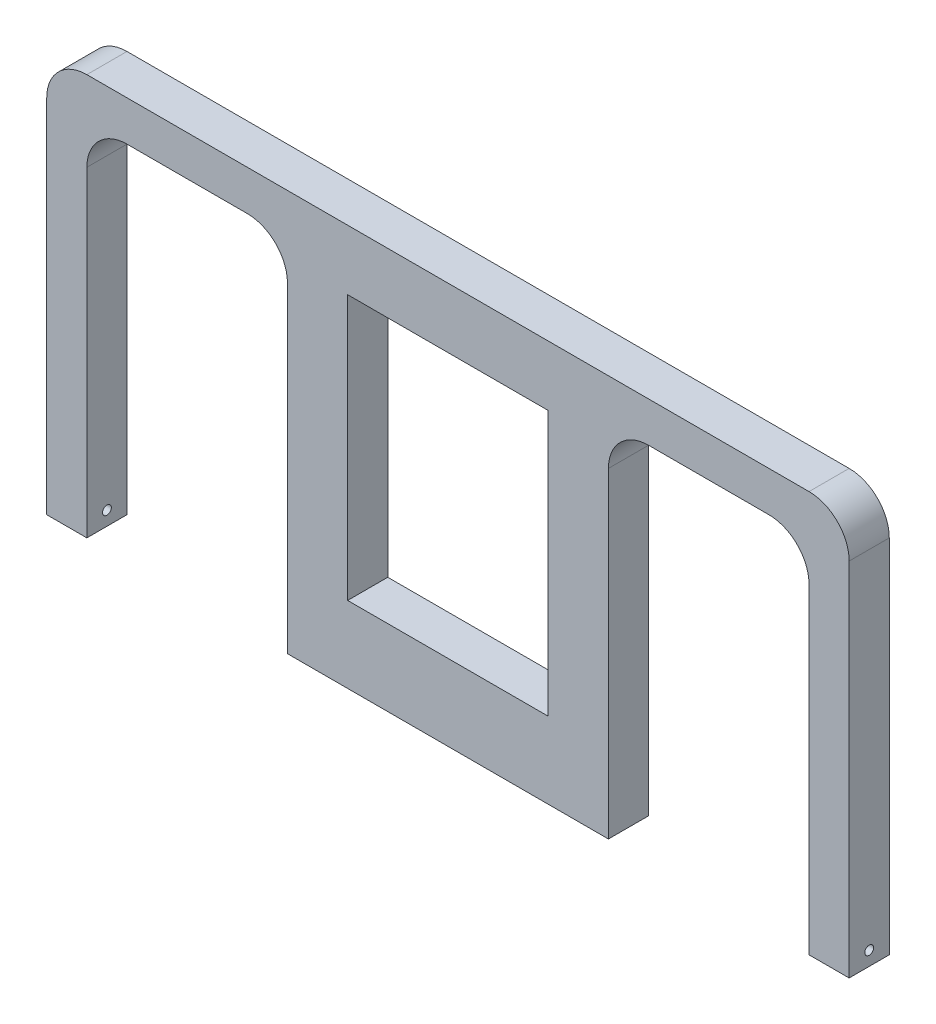
ISO-10303-21;
HEADER;
FILE_DESCRIPTION(('STEP AP214'),'2;1');
FILE_NAME('part.step','',(''),(''),'','','');
FILE_SCHEMA(('AUTOMOTIVE_DESIGN { 1 0 10303 214 1 1 1 1 }'));
ENDSEC;
DATA;
#1=APPLICATION_CONTEXT('core data for automotive mechanical design processes');
#2=APPLICATION_PROTOCOL_DEFINITION('international standard','automotive_design',2000,#1);
#3=PRODUCT_CONTEXT('',#1,'mechanical');
#4=PRODUCT('Part','Part','',(#3));
#5=PRODUCT_RELATED_PRODUCT_CATEGORY('part','',(#4));
#6=PRODUCT_DEFINITION_FORMATION('','',#4);
#7=PRODUCT_DEFINITION_CONTEXT('part definition',#1,'design');
#8=PRODUCT_DEFINITION('design','',#6,#7);
#9=PRODUCT_DEFINITION_SHAPE('','',#8);
#10=(LENGTH_UNIT() NAMED_UNIT(*) SI_UNIT(.MILLI.,.METRE.));
#11=(NAMED_UNIT(*) PLANE_ANGLE_UNIT() SI_UNIT($,.RADIAN.));
#12=(NAMED_UNIT(*) SI_UNIT($,.STERADIAN.) SOLID_ANGLE_UNIT());
#13=UNCERTAINTY_MEASURE_WITH_UNIT(LENGTH_MEASURE(1.E-05),#10,'distance_accuracy_value','');
#14=(GEOMETRIC_REPRESENTATION_CONTEXT(3) GLOBAL_UNCERTAINTY_ASSIGNED_CONTEXT((#13)) GLOBAL_UNIT_ASSIGNED_CONTEXT((#10,
#11,#12)) REPRESENTATION_CONTEXT('',''));
#15=CARTESIAN_POINT('',(0.,0.,0.));
#16=DIRECTION('',(0.,0.,1.));
#17=DIRECTION('',(1.,0.,0.));
#18=AXIS2_PLACEMENT_3D('',#15,#16,#17);
#19=CARTESIAN_POINT('',(-127.,114.3,12.7));
#20=DIRECTION('',(0.,0.,-1.));
#21=DIRECTION('',(-1.,0.,0.));
#22=AXIS2_PLACEMENT_3D('',#19,#20,#21);
#23=PLANE('',#22);
#24=DIRECTION('',(-1.,0.,0.));
#25=VECTOR('',#24,1.);
#26=CARTESIAN_POINT('',(31.75,24.13,12.7));
#27=LINE('',#26,#25);
#28=CARTESIAN_POINT('',(31.75,24.13,12.7));
#29=VERTEX_POINT('',#28);
#30=CARTESIAN_POINT('',(-31.75,24.13,12.7));
#31=VERTEX_POINT('',#30);
#32=EDGE_CURVE('E191',#29,#31,#27,.T.);
#33=ORIENTED_EDGE('',*,*,#32,.T.);
#34=DIRECTION('',(0.,1.,0.));
#35=VECTOR('',#34,1.);
#36=CARTESIAN_POINT('',(-31.75,107.95,12.7));
#37=LINE('',#36,#35);
#38=CARTESIAN_POINT('',(-31.75,107.95,12.7));
#39=VERTEX_POINT('',#38);
#40=EDGE_CURVE('E185',#31,#39,#37,.T.);
#41=ORIENTED_EDGE('',*,*,#40,.T.);
#42=DIRECTION('',(1.,0.,0.));
#43=VECTOR('',#42,1.);
#44=CARTESIAN_POINT('',(31.75,107.95,12.7));
#45=LINE('',#44,#43);
#46=CARTESIAN_POINT('',(31.75,107.95,12.6999999999998));
#47=VERTEX_POINT('',#46);
#48=EDGE_CURVE('E194',#39,#47,#45,.T.);
#49=ORIENTED_EDGE('',*,*,#48,.T.);
#50=DIRECTION('',(0.,-1.,0.));
#51=VECTOR('',#50,1.);
#52=CARTESIAN_POINT('',(31.75,107.95,12.7));
#53=LINE('',#52,#51);
#54=EDGE_CURVE('E50',#47,#29,#53,.T.);
#55=ORIENTED_EDGE('',*,*,#54,.T.);
#56=EDGE_LOOP('',(#33,#41,#49,#55));
#57=FACE_BOUND('',#56,.T.);
#58=CARTESIAN_POINT('',(-114.3,114.3,12.7));
#59=DIRECTION('',(0.,0.,-1.));
#60=DIRECTION('',(-1.,0.,0.));
#61=AXIS2_PLACEMENT_3D('',#58,#59,#60);
#62=CIRCLE('',#61,12.7);
#63=CARTESIAN_POINT('',(-127.,114.3,12.7));
#64=VERTEX_POINT('',#63);
#65=CARTESIAN_POINT('',(-114.3,127.,12.7));
#66=VERTEX_POINT('',#65);
#67=EDGE_CURVE('E219',#64,#66,#62,.T.);
#68=ORIENTED_EDGE('',*,*,#67,.F.);
#69=DIRECTION('',(0.,-1.,0.));
#70=VECTOR('',#69,1.);
#71=CARTESIAN_POINT('',(-127.,114.3,12.7));
#72=LINE('',#71,#70);
#73=CARTESIAN_POINT('',(-127.,0.,12.7));
#74=VERTEX_POINT('',#73);
#75=EDGE_CURVE('E11',#64,#74,#72,.T.);
#76=ORIENTED_EDGE('',*,*,#75,.T.);
#77=DIRECTION('',(1.,0.,0.));
#78=VECTOR('',#77,1.);
#79=CARTESIAN_POINT('',(-127.,0.,12.7));
#80=LINE('',#79,#78);
#81=CARTESIAN_POINT('',(-114.3,0.,12.7));
#82=VERTEX_POINT('',#81);
#83=EDGE_CURVE('E351',#74,#82,#80,.T.);
#84=ORIENTED_EDGE('',*,*,#83,.T.);
#85=DIRECTION('',(0.,-1.,0.));
#86=VECTOR('',#85,1.);
#87=CARTESIAN_POINT('',(-114.3,114.3,12.7));
#88=LINE('',#87,#86);
#89=CARTESIAN_POINT('',(-114.3,101.6,12.7));
#90=VERTEX_POINT('',#89);
#91=EDGE_CURVE('E43',#90,#82,#88,.T.);
#92=ORIENTED_EDGE('',*,*,#91,.F.);
#93=CARTESIAN_POINT('',(-101.6,101.6,12.7));
#94=DIRECTION('',(0.,0.,-1.));
#95=DIRECTION('',(-1.,0.,0.));
#96=AXIS2_PLACEMENT_3D('',#93,#94,#95);
#97=CIRCLE('',#96,12.7);
#98=CARTESIAN_POINT('',(-101.6,114.3,12.7));
#99=VERTEX_POINT('',#98);
#100=EDGE_CURVE('E248',#90,#99,#97,.T.);
#101=ORIENTED_EDGE('',*,*,#100,.T.);
#102=DIRECTION('',(-1.,0.,0.));
#103=VECTOR('',#102,1.);
#104=CARTESIAN_POINT('',(144.960512242138,114.3,12.7));
#105=LINE('',#104,#103);
#106=CARTESIAN_POINT('',(-63.5,114.3,12.7));
#107=VERTEX_POINT('',#106);
#108=EDGE_CURVE('E345',#107,#99,#105,.T.);
#109=ORIENTED_EDGE('',*,*,#108,.F.);
#110=CARTESIAN_POINT('',(-63.5,101.6,12.7));
#111=DIRECTION('',(0.,0.,-1.));
#112=DIRECTION('',(1.,0.,0.));
#113=AXIS2_PLACEMENT_3D('',#110,#111,#112);
#114=CIRCLE('',#113,12.7);
#115=CARTESIAN_POINT('',(-50.8,101.6,12.7));
#116=VERTEX_POINT('',#115);
#117=EDGE_CURVE('E239',#107,#116,#114,.T.);
#118=ORIENTED_EDGE('',*,*,#117,.T.);
#119=DIRECTION('',(0.,1.,0.));
#120=VECTOR('',#119,1.);
#121=CARTESIAN_POINT('',(-50.8,0.,12.6999999999999));
#122=LINE('',#121,#120);
#123=CARTESIAN_POINT('',(-50.8,0.,12.6999999999999));
#124=VERTEX_POINT('',#123);
#125=EDGE_CURVE('E303',#124,#116,#122,.T.);
#126=ORIENTED_EDGE('',*,*,#125,.F.);
#127=DIRECTION('',(-1.,0.,0.));
#128=VECTOR('',#127,1.);
#129=CARTESIAN_POINT('',(50.8,0.,12.6999999999999));
#130=LINE('',#129,#128);
#131=CARTESIAN_POINT('',(50.8,0.,12.6999999999999));
#132=VERTEX_POINT('',#131);
#133=EDGE_CURVE('E301',#132,#124,#130,.T.);
#134=ORIENTED_EDGE('',*,*,#133,.F.);
#135=DIRECTION('',(0.,1.,0.));
#136=VECTOR('',#135,1.);
#137=CARTESIAN_POINT('',(50.8,0.,12.6999999999999));
#138=LINE('',#137,#136);
#139=CARTESIAN_POINT('',(50.8,101.6,12.6999999999999));
#140=VERTEX_POINT('',#139);
#141=EDGE_CURVE('E306',#132,#140,#138,.T.);
#142=ORIENTED_EDGE('',*,*,#141,.T.);
#143=CARTESIAN_POINT('',(63.5,101.6,12.7));
#144=DIRECTION('',(0.,0.,1.));
#145=DIRECTION('',(-1.,0.,0.));
#146=AXIS2_PLACEMENT_3D('',#143,#144,#145);
#147=CIRCLE('',#146,12.7);
#148=CARTESIAN_POINT('',(63.5,114.3,12.7));
#149=VERTEX_POINT('',#148);
#150=EDGE_CURVE('E260',#149,#140,#147,.T.);
#151=ORIENTED_EDGE('',*,*,#150,.F.);
#152=CARTESIAN_POINT('',(101.6,114.3,12.6999999999997));
#153=VERTEX_POINT('',#152);
#154=EDGE_CURVE('E343',#153,#149,#105,.T.);
#155=ORIENTED_EDGE('',*,*,#154,.F.);
#156=CARTESIAN_POINT('',(101.6,101.6,12.7));
#157=DIRECTION('',(0.,0.,1.));
#158=DIRECTION('',(1.,0.,0.));
#159=AXIS2_PLACEMENT_3D('',#156,#157,#158);
#160=CIRCLE('',#159,12.7);
#161=CARTESIAN_POINT('',(114.3,101.6,12.6999999999999));
#162=VERTEX_POINT('',#161);
#163=EDGE_CURVE('E271',#162,#153,#160,.T.);
#164=ORIENTED_EDGE('',*,*,#163,.F.);
#165=DIRECTION('',(0.,-1.,0.));
#166=VECTOR('',#165,1.);
#167=CARTESIAN_POINT('',(114.3,114.3,12.6999999999999));
#168=LINE('',#167,#166);
#169=CARTESIAN_POINT('',(114.3,0.,12.6999999999999));
#170=VERTEX_POINT('',#169);
#171=EDGE_CURVE('E326',#162,#170,#168,.T.);
#172=ORIENTED_EDGE('',*,*,#171,.T.);
#173=DIRECTION('',(1.,0.,0.));
#174=VECTOR('',#173,1.);
#175=CARTESIAN_POINT('',(127.,0.,12.7));
#176=LINE('',#175,#174);
#177=CARTESIAN_POINT('',(127.,0.,12.7));
#178=VERTEX_POINT('',#177);
#179=EDGE_CURVE('E323',#170,#178,#176,.T.);
#180=ORIENTED_EDGE('',*,*,#179,.T.);
#181=DIRECTION('',(0.,-1.,0.));
#182=VECTOR('',#181,1.);
#183=CARTESIAN_POINT('',(127.,114.3,12.7));
#184=LINE('',#183,#182);
#185=CARTESIAN_POINT('',(127.,114.3,12.7));
#186=VERTEX_POINT('',#185);
#187=EDGE_CURVE('E331',#186,#178,#184,.T.);
#188=ORIENTED_EDGE('',*,*,#187,.F.);
#189=CARTESIAN_POINT('',(114.3,114.3,12.7));
#190=DIRECTION('',(0.,0.,1.));
#191=DIRECTION('',(1.,0.,0.));
#192=AXIS2_PLACEMENT_3D('',#189,#190,#191);
#193=CIRCLE('',#192,12.7);
#194=CARTESIAN_POINT('',(114.3,127.,12.7));
#195=VERTEX_POINT('',#194);
#196=EDGE_CURVE('E229',#186,#195,#193,.T.);
#197=ORIENTED_EDGE('',*,*,#196,.T.);
#198=DIRECTION('',(-1.,0.,0.));
#199=VECTOR('',#198,1.);
#200=CARTESIAN_POINT('',(144.960512242138,127.,12.7));
#201=LINE('',#200,#199);
#202=EDGE_CURVE('E340',#195,#66,#201,.T.);
#203=ORIENTED_EDGE('',*,*,#202,.T.);
#204=EDGE_LOOP('',(#68,#76,#84,#92,#101,#109,#118,#126,#134,#142,#151,#155,#164,#172,#180,#188,
#197,#203));
#205=FACE_BOUND('',#204,.T.);
#206=ADVANCED_FACE('F35',(#57,#205),#23,.F.);
#207=CARTESIAN_POINT('',(-127.,114.3,0.));
#208=DIRECTION('',(0.,0.,1.));
#209=DIRECTION('',(1.,0.,0.));
#210=AXIS2_PLACEMENT_3D('',#207,#208,#209);
#211=PLANE('',#210);
#212=DIRECTION('',(1.,0.,0.));
#213=VECTOR('',#212,1.);
#214=CARTESIAN_POINT('',(31.75,107.95,0.));
#215=LINE('',#214,#213);
#216=CARTESIAN_POINT('',(-31.75,107.95,0.));
#217=VERTEX_POINT('',#216);
#218=CARTESIAN_POINT('',(31.75,107.95,0.));
#219=VERTEX_POINT('',#218);
#220=EDGE_CURVE('E209',#217,#219,#215,.T.);
#221=ORIENTED_EDGE('',*,*,#220,.F.);
#222=DIRECTION('',(0.,1.,0.));
#223=VECTOR('',#222,1.);
#224=CARTESIAN_POINT('',(-31.75,107.95,0.));
#225=LINE('',#224,#223);
#226=CARTESIAN_POINT('',(-31.75,24.13,0.));
#227=VERTEX_POINT('',#226);
#228=EDGE_CURVE('E58',#227,#217,#225,.T.);
#229=ORIENTED_EDGE('',*,*,#228,.F.);
#230=DIRECTION('',(-1.,0.,0.));
#231=VECTOR('',#230,1.);
#232=CARTESIAN_POINT('',(31.75,24.13,0.));
#233=LINE('',#232,#231);
#234=CARTESIAN_POINT('',(31.75,24.13,0.));
#235=VERTEX_POINT('',#234);
#236=EDGE_CURVE('E200',#235,#227,#233,.T.);
#237=ORIENTED_EDGE('',*,*,#236,.F.);
#238=DIRECTION('',(0.,-1.,0.));
#239=VECTOR('',#238,1.);
#240=CARTESIAN_POINT('',(31.75,107.95,0.));
#241=LINE('',#240,#239);
#242=EDGE_CURVE('E203',#219,#235,#241,.T.);
#243=ORIENTED_EDGE('',*,*,#242,.F.);
#244=EDGE_LOOP('',(#221,#229,#237,#243));
#245=FACE_BOUND('',#244,.T.);
#246=CARTESIAN_POINT('',(-114.3,114.3,0.));
#247=DIRECTION('',(0.,0.,-1.));
#248=DIRECTION('',(-1.,0.,0.));
#249=AXIS2_PLACEMENT_3D('',#246,#247,#248);
#250=CIRCLE('',#249,12.7);
#251=CARTESIAN_POINT('',(-127.,114.3,0.));
#252=VERTEX_POINT('',#251);
#253=CARTESIAN_POINT('',(-114.3,127.,0.));
#254=VERTEX_POINT('',#253);
#255=EDGE_CURVE('E215',#252,#254,#250,.T.);
#256=ORIENTED_EDGE('',*,*,#255,.T.);
#257=DIRECTION('',(-1.,0.,0.));
#258=VECTOR('',#257,1.);
#259=CARTESIAN_POINT('',(144.960512242138,127.,0.));
#260=LINE('',#259,#258);
#261=CARTESIAN_POINT('',(114.3,127.,0.));
#262=VERTEX_POINT('',#261);
#263=EDGE_CURVE('E334',#262,#254,#260,.T.);
#264=ORIENTED_EDGE('',*,*,#263,.F.);
#265=CARTESIAN_POINT('',(114.3,114.3,0.));
#266=DIRECTION('',(0.,0.,1.));
#267=DIRECTION('',(1.,0.,0.));
#268=AXIS2_PLACEMENT_3D('',#265,#266,#267);
#269=CIRCLE('',#268,12.7);
#270=CARTESIAN_POINT('',(127.,114.3,0.));
#271=VERTEX_POINT('',#270);
#272=EDGE_CURVE('E227',#271,#262,#269,.T.);
#273=ORIENTED_EDGE('',*,*,#272,.F.);
#274=DIRECTION('',(0.,1.,0.));
#275=VECTOR('',#274,1.);
#276=CARTESIAN_POINT('',(127.,114.3,0.));
#277=LINE('',#276,#275);
#278=CARTESIAN_POINT('',(127.,0.,0.));
#279=VERTEX_POINT('',#278);
#280=EDGE_CURVE('E333',#279,#271,#277,.T.);
#281=ORIENTED_EDGE('',*,*,#280,.F.);
#282=DIRECTION('',(-1.,0.,0.));
#283=VECTOR('',#282,1.);
#284=CARTESIAN_POINT('',(127.,0.,0.));
#285=LINE('',#284,#283);
#286=CARTESIAN_POINT('',(114.3,0.,0.));
#287=VERTEX_POINT('',#286);
#288=EDGE_CURVE('E317',#279,#287,#285,.T.);
#289=ORIENTED_EDGE('',*,*,#288,.T.);
#290=DIRECTION('',(0.,-1.,0.));
#291=VECTOR('',#290,1.);
#292=CARTESIAN_POINT('',(114.3,114.3,0.));
#293=LINE('',#292,#291);
#294=CARTESIAN_POINT('',(114.3,101.6,0.));
#295=VERTEX_POINT('',#294);
#296=EDGE_CURVE('E328',#295,#287,#293,.T.);
#297=ORIENTED_EDGE('',*,*,#296,.F.);
#298=CARTESIAN_POINT('',(101.6,101.6,0.));
#299=DIRECTION('',(0.,0.,1.));
#300=DIRECTION('',(1.,0.,0.));
#301=AXIS2_PLACEMENT_3D('',#298,#299,#300);
#302=CIRCLE('',#301,12.7);
#303=CARTESIAN_POINT('',(101.6,114.3,0.));
#304=VERTEX_POINT('',#303);
#305=EDGE_CURVE('E269',#295,#304,#302,.T.);
#306=ORIENTED_EDGE('',*,*,#305,.T.);
#307=DIRECTION('',(-1.,0.,0.));
#308=VECTOR('',#307,1.);
#309=CARTESIAN_POINT('',(144.960512242138,114.3,0.));
#310=LINE('',#309,#308);
#311=CARTESIAN_POINT('',(63.5,114.3,0.));
#312=VERTEX_POINT('',#311);
#313=EDGE_CURVE('E346',#304,#312,#310,.T.);
#314=ORIENTED_EDGE('',*,*,#313,.T.);
#315=CARTESIAN_POINT('',(63.5,101.6,0.));
#316=DIRECTION('',(0.,0.,1.));
#317=DIRECTION('',(-1.,0.,0.));
#318=AXIS2_PLACEMENT_3D('',#315,#316,#317);
#319=CIRCLE('',#318,12.7);
#320=CARTESIAN_POINT('',(50.8,101.6,0.));
#321=VERTEX_POINT('',#320);
#322=EDGE_CURVE('E257',#312,#321,#319,.T.);
#323=ORIENTED_EDGE('',*,*,#322,.T.);
#324=DIRECTION('',(0.,1.,0.));
#325=VECTOR('',#324,1.);
#326=CARTESIAN_POINT('',(50.8,0.,0.));
#327=LINE('',#326,#325);
#328=CARTESIAN_POINT('',(50.8,0.,0.));
#329=VERTEX_POINT('',#328);
#330=EDGE_CURVE('E309',#329,#321,#327,.T.);
#331=ORIENTED_EDGE('',*,*,#330,.F.);
#332=DIRECTION('',(1.,0.,0.));
#333=VECTOR('',#332,1.);
#334=CARTESIAN_POINT('',(50.8,0.,0.));
#335=LINE('',#334,#333);
#336=CARTESIAN_POINT('',(-50.8,0.,0.));
#337=VERTEX_POINT('',#336);
#338=EDGE_CURVE('E297',#337,#329,#335,.T.);
#339=ORIENTED_EDGE('',*,*,#338,.F.);
#340=DIRECTION('',(0.,1.,0.));
#341=VECTOR('',#340,1.);
#342=CARTESIAN_POINT('',(-50.8,0.,0.));
#343=LINE('',#342,#341);
#344=CARTESIAN_POINT('',(-50.8,101.6,0.));
#345=VERTEX_POINT('',#344);
#346=EDGE_CURVE('E311',#337,#345,#343,.T.);
#347=ORIENTED_EDGE('',*,*,#346,.T.);
#348=CARTESIAN_POINT('',(-63.5,101.6,0.));
#349=DIRECTION('',(0.,0.,-1.));
#350=DIRECTION('',(1.,0.,0.));
#351=AXIS2_PLACEMENT_3D('',#348,#349,#350);
#352=CIRCLE('',#351,12.7);
#353=CARTESIAN_POINT('',(-63.5,114.3,0.));
#354=VERTEX_POINT('',#353);
#355=EDGE_CURVE('E237',#354,#345,#352,.T.);
#356=ORIENTED_EDGE('',*,*,#355,.F.);
#357=CARTESIAN_POINT('',(-101.6,114.3,0.));
#358=VERTEX_POINT('',#357);
#359=EDGE_CURVE('E330',#354,#358,#310,.T.);
#360=ORIENTED_EDGE('',*,*,#359,.T.);
#361=CARTESIAN_POINT('',(-101.6,101.6,0.));
#362=DIRECTION('',(0.,0.,-1.));
#363=DIRECTION('',(-1.,0.,0.));
#364=AXIS2_PLACEMENT_3D('',#361,#362,#363);
#365=CIRCLE('',#364,12.7);
#366=CARTESIAN_POINT('',(-114.3,101.6,0.));
#367=VERTEX_POINT('',#366);
#368=EDGE_CURVE('E245',#367,#358,#365,.T.);
#369=ORIENTED_EDGE('',*,*,#368,.F.);
#370=DIRECTION('',(0.,-1.,0.));
#371=VECTOR('',#370,1.);
#372=CARTESIAN_POINT('',(-114.3,114.3,0.));
#373=LINE('',#372,#371);
#374=CARTESIAN_POINT('',(-114.3,0.,0.));
#375=VERTEX_POINT('',#374);
#376=EDGE_CURVE('E362',#367,#375,#373,.T.);
#377=ORIENTED_EDGE('',*,*,#376,.T.);
#378=DIRECTION('',(-1.,0.,0.));
#379=VECTOR('',#378,1.);
#380=CARTESIAN_POINT('',(-127.,0.,0.));
#381=LINE('',#380,#379);
#382=CARTESIAN_POINT('',(-127.,0.,0.));
#383=VERTEX_POINT('',#382);
#384=EDGE_CURVE('E357',#375,#383,#381,.T.);
#385=ORIENTED_EDGE('',*,*,#384,.T.);
#386=DIRECTION('',(0.,-1.,0.));
#387=VECTOR('',#386,1.);
#388=CARTESIAN_POINT('',(-127.,114.3,0.));
#389=LINE('',#388,#387);
#390=EDGE_CURVE('E360',#252,#383,#389,.T.);
#391=ORIENTED_EDGE('',*,*,#390,.F.);
#392=EDGE_LOOP('',(#256,#264,#273,#281,#289,#297,#306,#314,#323,#331,#339,#347,#356,#360,#369,
#377,#385,#391));
#393=FACE_BOUND('',#392,.T.);
#394=ADVANCED_FACE('F378',(#245,#393),#211,.F.);
#395=CARTESIAN_POINT('',(144.960512242138,114.3,0.));
#396=DIRECTION('',(0.,-1.,0.));
#397=DIRECTION('',(0.,0.,-1.));
#398=AXIS2_PLACEMENT_3D('',#395,#396,#397);
#399=PLANE('',#398);
#400=DIRECTION('',(0.,0.,-1.));
#401=VECTOR('',#400,1.);
#402=CARTESIAN_POINT('',(-63.5,114.3,12.7));
#403=LINE('',#402,#401);
#404=EDGE_CURVE('E243',#107,#354,#403,.T.);
#405=ORIENTED_EDGE('',*,*,#404,.F.);
#406=ORIENTED_EDGE('',*,*,#108,.T.);
#407=DIRECTION('',(0.,0.,-1.));
#408=VECTOR('',#407,1.);
#409=CARTESIAN_POINT('',(-101.6,114.3,12.7));
#410=LINE('',#409,#408);
#411=EDGE_CURVE('E251',#99,#358,#410,.T.);
#412=ORIENTED_EDGE('',*,*,#411,.T.);
#413=ORIENTED_EDGE('',*,*,#359,.F.);
#414=EDGE_LOOP('',(#405,#406,#412,#413));
#415=FACE_BOUND('',#414,.T.);
#416=ADVANCED_FACE('F389',(#415),#399,.T.);
#417=CARTESIAN_POINT('',(-114.3,114.3,0.));
#418=DIRECTION('',(-1.,0.,0.));
#419=DIRECTION('',(0.,0.,1.));
#420=AXIS2_PLACEMENT_3D('',#417,#418,#419);
#421=PLANE('',#420);
#422=CARTESIAN_POINT('',(-114.3,4.445,6.34999999999997));
#423=DIRECTION('',(-1.,0.,0.));
#424=DIRECTION('',(0.,0.,1.));
#425=AXIS2_PLACEMENT_3D('',#422,#423,#424);
#426=CIRCLE('',#425,1.397);
#427=CARTESIAN_POINT('',(-114.3,4.445,7.74699999999997));
#428=VERTEX_POINT('',#427);
#429=EDGE_CURVE('E283',#428,#428,#426,.T.);
#430=ORIENTED_EDGE('',*,*,#429,.T.);
#431=EDGE_LOOP('',(#430));
#432=FACE_BOUND('',#431,.T.);
#433=DIRECTION('',(0.,0.,-1.));
#434=VECTOR('',#433,1.);
#435=CARTESIAN_POINT('',(-114.3,101.6,12.7));
#436=LINE('',#435,#434);
#437=EDGE_CURVE('E254',#90,#367,#436,.T.);
#438=ORIENTED_EDGE('',*,*,#437,.F.);
#439=ORIENTED_EDGE('',*,*,#91,.T.);
#440=DIRECTION('',(0.,0.,-1.));
#441=VECTOR('',#440,1.);
#442=CARTESIAN_POINT('',(-114.3,0.,0.));
#443=LINE('',#442,#441);
#444=EDGE_CURVE('E354',#82,#375,#443,.T.);
#445=ORIENTED_EDGE('',*,*,#444,.T.);
#446=ORIENTED_EDGE('',*,*,#376,.F.);
#447=EDGE_LOOP('',(#438,#439,#445,#446));
#448=FACE_BOUND('',#447,.T.);
#449=ADVANCED_FACE('F366',(#432,#448),#421,.F.);
#450=DIRECTION('',(0.,0.,-1.));
#451=VECTOR('',#450,1.);
#452=CARTESIAN_POINT('',(63.5,114.3,12.7));
#453=LINE('',#452,#451);
#454=EDGE_CURVE('E263',#149,#312,#453,.T.);
#455=ORIENTED_EDGE('',*,*,#454,.T.);
#456=ORIENTED_EDGE('',*,*,#313,.F.);
#457=DIRECTION('',(0.,0.,-1.));
#458=VECTOR('',#457,1.);
#459=CARTESIAN_POINT('',(101.6,114.3,12.7));
#460=LINE('',#459,#458);
#461=EDGE_CURVE('E277',#153,#304,#460,.T.);
#462=ORIENTED_EDGE('',*,*,#461,.F.);
#463=ORIENTED_EDGE('',*,*,#154,.T.);
#464=EDGE_LOOP('',(#455,#456,#462,#463));
#465=FACE_BOUND('',#464,.T.);
#466=ADVANCED_FACE('F411',(#465),#399,.T.);
#467=CARTESIAN_POINT('',(114.3,114.3,12.6999999999999));
#468=DIRECTION('',(1.,0.,0.));
#469=DIRECTION('',(0.,0.,-1.));
#470=AXIS2_PLACEMENT_3D('',#467,#468,#469);
#471=PLANE('',#470);
#472=CARTESIAN_POINT('',(114.3,4.445,6.34999999999997));
#473=DIRECTION('',(1.,0.,0.));
#474=DIRECTION('',(0.,0.,-1.));
#475=AXIS2_PLACEMENT_3D('',#472,#473,#474);
#476=CIRCLE('',#475,1.397);
#477=CARTESIAN_POINT('',(114.3,4.445,4.95299999999997));
#478=VERTEX_POINT('',#477);
#479=EDGE_CURVE('E286',#478,#478,#476,.F.);
#480=ORIENTED_EDGE('',*,*,#479,.F.);
#481=EDGE_LOOP('',(#480));
#482=FACE_BOUND('',#481,.T.);
#483=DIRECTION('',(0.,0.,-1.));
#484=VECTOR('',#483,1.);
#485=CARTESIAN_POINT('',(114.3,101.6,12.7));
#486=LINE('',#485,#484);
#487=EDGE_CURVE('E274',#162,#295,#486,.T.);
#488=ORIENTED_EDGE('',*,*,#487,.T.);
#489=ORIENTED_EDGE('',*,*,#296,.T.);
#490=DIRECTION('',(0.,0.,1.));
#491=VECTOR('',#490,1.);
#492=CARTESIAN_POINT('',(114.3,0.,12.6999999999999));
#493=LINE('',#492,#491);
#494=EDGE_CURVE('E320',#287,#170,#493,.T.);
#495=ORIENTED_EDGE('',*,*,#494,.T.);
#496=ORIENTED_EDGE('',*,*,#171,.F.);
#497=EDGE_LOOP('',(#488,#489,#495,#496));
#498=FACE_BOUND('',#497,.T.);
#499=ADVANCED_FACE('F422',(#482,#498),#471,.F.);
#500=CARTESIAN_POINT('',(-127.,114.3,0.));
#501=DIRECTION('',(1.,0.,0.));
#502=DIRECTION('',(0.,0.,-1.));
#503=AXIS2_PLACEMENT_3D('',#500,#501,#502);
#504=PLANE('',#503);
#505=CARTESIAN_POINT('',(-127.,4.445,6.34999999999997));
#506=DIRECTION('',(1.,0.,0.));
#507=DIRECTION('',(0.,0.,-1.));
#508=AXIS2_PLACEMENT_3D('',#505,#506,#507);
#509=CIRCLE('',#508,1.397);
#510=CARTESIAN_POINT('',(-127.,4.445,4.95299999999997));
#511=VERTEX_POINT('',#510);
#512=EDGE_CURVE('E280',#511,#511,#509,.T.);
#513=ORIENTED_EDGE('',*,*,#512,.T.);
#514=EDGE_LOOP('',(#513));
#515=FACE_BOUND('',#514,.T.);
#516=ORIENTED_EDGE('',*,*,#75,.F.);
#517=DIRECTION('',(0.,0.,-1.));
#518=VECTOR('',#517,1.);
#519=CARTESIAN_POINT('',(-127.,114.3,12.7));
#520=LINE('',#519,#518);
#521=EDGE_CURVE('E224',#64,#252,#520,.T.);
#522=ORIENTED_EDGE('',*,*,#521,.T.);
#523=ORIENTED_EDGE('',*,*,#390,.T.);
#524=DIRECTION('',(0.,0.,1.));
#525=VECTOR('',#524,1.);
#526=CARTESIAN_POINT('',(-127.,0.,0.));
#527=LINE('',#526,#525);
#528=EDGE_CURVE('E337',#383,#74,#527,.T.);
#529=ORIENTED_EDGE('',*,*,#528,.T.);
#530=EDGE_LOOP('',(#516,#522,#523,#529));
#531=FACE_BOUND('',#530,.T.);
#532=ADVANCED_FACE('F37',(#515,#531),#504,.F.);
#533=CARTESIAN_POINT('',(0.,0.,0.));
#534=DIRECTION('',(0.,1.,0.));
#535=DIRECTION('',(0.,0.,1.));
#536=AXIS2_PLACEMENT_3D('',#533,#534,#535);
#537=PLANE('',#536);
#538=ORIENTED_EDGE('',*,*,#528,.F.);
#539=ORIENTED_EDGE('',*,*,#384,.F.);
#540=ORIENTED_EDGE('',*,*,#444,.F.);
#541=ORIENTED_EDGE('',*,*,#83,.F.);
#542=EDGE_LOOP('',(#538,#539,#540,#541));
#543=FACE_BOUND('',#542,.T.);
#544=ADVANCED_FACE('F375',(#543),#537,.F.);
#545=CARTESIAN_POINT('',(144.960512242138,127.,0.));
#546=DIRECTION('',(0.,1.,0.));
#547=DIRECTION('',(0.,0.,1.));
#548=AXIS2_PLACEMENT_3D('',#545,#546,#547);
#549=PLANE('',#548);
#550=DIRECTION('',(0.,0.,-1.));
#551=VECTOR('',#550,1.);
#552=CARTESIAN_POINT('',(-114.3,127.,12.7));
#553=LINE('',#552,#551);
#554=EDGE_CURVE('E221',#66,#254,#553,.T.);
#555=ORIENTED_EDGE('',*,*,#554,.F.);
#556=ORIENTED_EDGE('',*,*,#202,.F.);
#557=DIRECTION('',(0.,0.,-1.));
#558=VECTOR('',#557,1.);
#559=CARTESIAN_POINT('',(114.3,127.,12.7));
#560=LINE('',#559,#558);
#561=EDGE_CURVE('E234',#195,#262,#560,.T.);
#562=ORIENTED_EDGE('',*,*,#561,.T.);
#563=ORIENTED_EDGE('',*,*,#263,.T.);
#564=EDGE_LOOP('',(#555,#556,#562,#563));
#565=FACE_BOUND('',#564,.T.);
#566=ADVANCED_FACE('F433',(#565),#549,.T.);
#567=CARTESIAN_POINT('',(127.,114.3,12.7));
#568=DIRECTION('',(-1.,0.,0.));
#569=DIRECTION('',(0.,0.,1.));
#570=AXIS2_PLACEMENT_3D('',#567,#568,#569);
#571=PLANE('',#570);
#572=CARTESIAN_POINT('',(127.,4.445,6.34999999999997));
#573=DIRECTION('',(1.,0.,0.));
#574=DIRECTION('',(0.,0.,-1.));
#575=AXIS2_PLACEMENT_3D('',#572,#573,#574);
#576=CIRCLE('',#575,1.397);
#577=CARTESIAN_POINT('',(127.,4.445,4.95299999999997));
#578=VERTEX_POINT('',#577);
#579=EDGE_CURVE('E291',#578,#578,#576,.T.);
#580=ORIENTED_EDGE('',*,*,#579,.F.);
#581=EDGE_LOOP('',(#580));
#582=FACE_BOUND('',#581,.T.);
#583=ORIENTED_EDGE('',*,*,#280,.T.);
#584=DIRECTION('',(0.,0.,-1.));
#585=VECTOR('',#584,1.);
#586=CARTESIAN_POINT('',(127.,114.3,12.7));
#587=LINE('',#586,#585);
#588=EDGE_CURVE('E232',#186,#271,#587,.T.);
#589=ORIENTED_EDGE('',*,*,#588,.F.);
#590=ORIENTED_EDGE('',*,*,#187,.T.);
#591=DIRECTION('',(0.,0.,-1.));
#592=VECTOR('',#591,1.);
#593=CARTESIAN_POINT('',(127.,0.,12.7));
#594=LINE('',#593,#592);
#595=EDGE_CURVE('E314',#178,#279,#594,.T.);
#596=ORIENTED_EDGE('',*,*,#595,.T.);
#597=EDGE_LOOP('',(#583,#589,#590,#596));
#598=FACE_BOUND('',#597,.T.);
#599=ADVANCED_FACE('F427',(#582,#598),#571,.F.);
#600=CARTESIAN_POINT('',(0.,0.,0.));
#601=DIRECTION('',(0.,1.,0.));
#602=DIRECTION('',(0.,0.,1.));
#603=AXIS2_PLACEMENT_3D('',#600,#601,#602);
#604=PLANE('',#603);
#605=ORIENTED_EDGE('',*,*,#595,.F.);
#606=ORIENTED_EDGE('',*,*,#179,.F.);
#607=ORIENTED_EDGE('',*,*,#494,.F.);
#608=ORIENTED_EDGE('',*,*,#288,.F.);
#609=EDGE_LOOP('',(#605,#606,#607,#608));
#610=FACE_BOUND('',#609,.T.);
#611=ADVANCED_FACE('F425',(#610),#604,.F.);
#612=CARTESIAN_POINT('',(-50.8,0.,12.6999999999999));
#613=DIRECTION('',(1.,0.,0.));
#614=DIRECTION('',(0.,0.,-1.));
#615=AXIS2_PLACEMENT_3D('',#612,#613,#614);
#616=PLANE('',#615);
#617=ORIENTED_EDGE('',*,*,#125,.T.);
#618=DIRECTION('',(0.,0.,-1.));
#619=VECTOR('',#618,1.);
#620=CARTESIAN_POINT('',(-50.8,101.6,12.7));
#621=LINE('',#620,#619);
#622=EDGE_CURVE('E241',#116,#345,#621,.T.);
#623=ORIENTED_EDGE('',*,*,#622,.T.);
#624=ORIENTED_EDGE('',*,*,#346,.F.);
#625=DIRECTION('',(0.,0.,-1.));
#626=VECTOR('',#625,1.);
#627=CARTESIAN_POINT('',(-50.8,0.,12.6999999999999));
#628=LINE('',#627,#626);
#629=EDGE_CURVE('E294',#124,#337,#628,.T.);
#630=ORIENTED_EDGE('',*,*,#629,.F.);
#631=EDGE_LOOP('',(#617,#623,#624,#630));
#632=FACE_BOUND('',#631,.T.);
#633=ADVANCED_FACE('F396',(#632),#616,.F.);
#634=CARTESIAN_POINT('',(50.8,0.,12.6999999999999));
#635=DIRECTION('',(-1.,0.,0.));
#636=DIRECTION('',(0.,0.,1.));
#637=AXIS2_PLACEMENT_3D('',#634,#635,#636);
#638=PLANE('',#637);
#639=ORIENTED_EDGE('',*,*,#330,.T.);
#640=DIRECTION('',(0.,0.,-1.));
#641=VECTOR('',#640,1.);
#642=CARTESIAN_POINT('',(50.8,101.6,12.7));
#643=LINE('',#642,#641);
#644=EDGE_CURVE('E266',#140,#321,#643,.T.);
#645=ORIENTED_EDGE('',*,*,#644,.F.);
#646=ORIENTED_EDGE('',*,*,#141,.F.);
#647=DIRECTION('',(0.,0.,1.));
#648=VECTOR('',#647,1.);
#649=CARTESIAN_POINT('',(50.8,0.,12.6999999999999));
#650=LINE('',#649,#648);
#651=EDGE_CURVE('E299',#329,#132,#650,.T.);
#652=ORIENTED_EDGE('',*,*,#651,.F.);
#653=EDGE_LOOP('',(#639,#645,#646,#652));
#654=FACE_BOUND('',#653,.T.);
#655=ADVANCED_FACE('F404',(#654),#638,.F.);
#656=CARTESIAN_POINT('',(0.,0.,0.));
#657=DIRECTION('',(0.,1.,0.));
#658=DIRECTION('',(0.,0.,1.));
#659=AXIS2_PLACEMENT_3D('',#656,#657,#658);
#660=PLANE('',#659);
#661=ORIENTED_EDGE('',*,*,#629,.T.);
#662=ORIENTED_EDGE('',*,*,#338,.T.);
#663=ORIENTED_EDGE('',*,*,#651,.T.);
#664=ORIENTED_EDGE('',*,*,#133,.T.);
#665=EDGE_LOOP('',(#661,#662,#663,#664));
#666=FACE_BOUND('',#665,.T.);
#667=ADVANCED_FACE('F401',(#666),#660,.F.);
#668=CARTESIAN_POINT('',(-127.001,4.445,6.34999999999997));
#669=DIRECTION('',(1.,0.,0.));
#670=DIRECTION('',(0.,0.,-1.));
#671=AXIS2_PLACEMENT_3D('',#668,#669,#670);
#672=CYLINDRICAL_SURFACE('',#671,1.397);
#673=ORIENTED_EDGE('',*,*,#579,.T.);
#674=EDGE_LOOP('',(#673));
#675=FACE_BOUND('',#674,.T.);
#676=ORIENTED_EDGE('',*,*,#479,.T.);
#677=EDGE_LOOP('',(#676));
#678=FACE_BOUND('',#677,.T.);
#679=ADVANCED_FACE('F477',(#675,#678),#672,.F.);
#680=CARTESIAN_POINT('',(127.001,4.445,6.34999999999997));
#681=DIRECTION('',(-1.,0.,0.));
#682=DIRECTION('',(0.,0.,1.));
#683=AXIS2_PLACEMENT_3D('',#680,#681,#682);
#684=CYLINDRICAL_SURFACE('',#683,1.397);
#685=ORIENTED_EDGE('',*,*,#512,.F.);
#686=EDGE_LOOP('',(#685));
#687=FACE_BOUND('',#686,.T.);
#688=ORIENTED_EDGE('',*,*,#429,.F.);
#689=EDGE_LOOP('',(#688));
#690=FACE_BOUND('',#689,.T.);
#691=ADVANCED_FACE('F480',(#687,#690),#684,.F.);
#692=CARTESIAN_POINT('',(101.6,101.6,12.7));
#693=DIRECTION('',(0.,0.,-1.));
#694=DIRECTION('',(-1.,0.,0.));
#695=AXIS2_PLACEMENT_3D('',#692,#693,#694);
#696=CYLINDRICAL_SURFACE('',#695,12.7);
#697=ORIENTED_EDGE('',*,*,#305,.F.);
#698=ORIENTED_EDGE('',*,*,#487,.F.);
#699=ORIENTED_EDGE('',*,*,#163,.T.);
#700=ORIENTED_EDGE('',*,*,#461,.T.);
#701=EDGE_LOOP('',(#697,#698,#699,#700));
#702=FACE_BOUND('',#701,.T.);
#703=ADVANCED_FACE('F414',(#702),#696,.F.);
#704=CARTESIAN_POINT('',(63.5,101.6,12.7));
#705=DIRECTION('',(0.,0.,-1.));
#706=DIRECTION('',(-1.,0.,0.));
#707=AXIS2_PLACEMENT_3D('',#704,#705,#706);
#708=CYLINDRICAL_SURFACE('',#707,12.7);
#709=ORIENTED_EDGE('',*,*,#322,.F.);
#710=ORIENTED_EDGE('',*,*,#454,.F.);
#711=ORIENTED_EDGE('',*,*,#150,.T.);
#712=ORIENTED_EDGE('',*,*,#644,.T.);
#713=EDGE_LOOP('',(#709,#710,#711,#712));
#714=FACE_BOUND('',#713,.T.);
#715=ADVANCED_FACE('F407',(#714),#708,.F.);
#716=CARTESIAN_POINT('',(-101.6,101.6,12.7));
#717=DIRECTION('',(0.,0.,-1.));
#718=DIRECTION('',(-1.,0.,0.));
#719=AXIS2_PLACEMENT_3D('',#716,#717,#718);
#720=CYLINDRICAL_SURFACE('',#719,12.7);
#721=ORIENTED_EDGE('',*,*,#368,.T.);
#722=ORIENTED_EDGE('',*,*,#411,.F.);
#723=ORIENTED_EDGE('',*,*,#100,.F.);
#724=ORIENTED_EDGE('',*,*,#437,.T.);
#725=EDGE_LOOP('',(#721,#722,#723,#724));
#726=FACE_BOUND('',#725,.T.);
#727=ADVANCED_FACE('F383',(#726),#720,.F.);
#728=CARTESIAN_POINT('',(-63.5,101.6,12.7));
#729=DIRECTION('',(0.,0.,-1.));
#730=DIRECTION('',(-1.,0.,0.));
#731=AXIS2_PLACEMENT_3D('',#728,#729,#730);
#732=CYLINDRICAL_SURFACE('',#731,12.7);
#733=ORIENTED_EDGE('',*,*,#355,.T.);
#734=ORIENTED_EDGE('',*,*,#622,.F.);
#735=ORIENTED_EDGE('',*,*,#117,.F.);
#736=ORIENTED_EDGE('',*,*,#404,.T.);
#737=EDGE_LOOP('',(#733,#734,#735,#736));
#738=FACE_BOUND('',#737,.T.);
#739=ADVANCED_FACE('F391',(#738),#732,.F.);
#740=CARTESIAN_POINT('',(114.3,114.3,12.7));
#741=DIRECTION('',(0.,0.,-1.));
#742=DIRECTION('',(-1.,0.,0.));
#743=AXIS2_PLACEMENT_3D('',#740,#741,#742);
#744=CYLINDRICAL_SURFACE('',#743,12.7);
#745=ORIENTED_EDGE('',*,*,#272,.T.);
#746=ORIENTED_EDGE('',*,*,#561,.F.);
#747=ORIENTED_EDGE('',*,*,#196,.F.);
#748=ORIENTED_EDGE('',*,*,#588,.T.);
#749=EDGE_LOOP('',(#745,#746,#747,#748));
#750=FACE_BOUND('',#749,.T.);
#751=ADVANCED_FACE('F438',(#750),#744,.T.);
#752=CARTESIAN_POINT('',(-114.3,114.3,12.7));
#753=DIRECTION('',(0.,0.,-1.));
#754=DIRECTION('',(-1.,0.,0.));
#755=AXIS2_PLACEMENT_3D('',#752,#753,#754);
#756=CYLINDRICAL_SURFACE('',#755,12.7);
#757=ORIENTED_EDGE('',*,*,#255,.F.);
#758=ORIENTED_EDGE('',*,*,#521,.F.);
#759=ORIENTED_EDGE('',*,*,#67,.T.);
#760=ORIENTED_EDGE('',*,*,#554,.T.);
#761=EDGE_LOOP('',(#757,#758,#759,#760));
#762=FACE_BOUND('',#761,.T.);
#763=ADVANCED_FACE('F436',(#762),#756,.T.);
#764=CARTESIAN_POINT('',(-31.75,107.95,12.7));
#765=DIRECTION('',(-1.,0.,0.));
#766=DIRECTION('',(0.,-1.,0.));
#767=AXIS2_PLACEMENT_3D('',#764,#765,#766);
#768=PLANE('',#767);
#769=ORIENTED_EDGE('',*,*,#228,.T.);
#770=DIRECTION('',(0.,0.,-1.));
#771=VECTOR('',#770,1.);
#772=CARTESIAN_POINT('',(-31.75,107.95,12.7));
#773=LINE('',#772,#771);
#774=EDGE_CURVE('E181',#39,#217,#773,.T.);
#775=ORIENTED_EDGE('',*,*,#774,.F.);
#776=ORIENTED_EDGE('',*,*,#40,.F.);
#777=DIRECTION('',(0.,0.,-1.));
#778=VECTOR('',#777,1.);
#779=CARTESIAN_POINT('',(-31.75,24.13,12.7));
#780=LINE('',#779,#778);
#781=EDGE_CURVE('E213',#31,#227,#780,.T.);
#782=ORIENTED_EDGE('',*,*,#781,.T.);
#783=EDGE_LOOP('',(#769,#775,#776,#782));
#784=FACE_BOUND('',#783,.T.);
#785=ADVANCED_FACE('F183',(#784),#768,.F.);
#786=CARTESIAN_POINT('',(31.75,24.13,12.7));
#787=DIRECTION('',(0.,-1.,0.));
#788=DIRECTION('',(0.,0.,-1.));
#789=AXIS2_PLACEMENT_3D('',#786,#787,#788);
#790=PLANE('',#789);
#791=ORIENTED_EDGE('',*,*,#236,.T.);
#792=ORIENTED_EDGE('',*,*,#781,.F.);
#793=ORIENTED_EDGE('',*,*,#32,.F.);
#794=DIRECTION('',(0.,0.,-1.));
#795=VECTOR('',#794,1.);
#796=CARTESIAN_POINT('',(31.75,24.13,12.7));
#797=LINE('',#796,#795);
#798=EDGE_CURVE('E216',#29,#235,#797,.T.);
#799=ORIENTED_EDGE('',*,*,#798,.T.);
#800=EDGE_LOOP('',(#791,#792,#793,#799));
#801=FACE_BOUND('',#800,.T.);
#802=ADVANCED_FACE('F555',(#801),#790,.F.);
#803=CARTESIAN_POINT('',(31.75,107.95,12.7));
#804=DIRECTION('',(1.,0.,0.));
#805=DIRECTION('',(0.,1.,0.));
#806=AXIS2_PLACEMENT_3D('',#803,#804,#805);
#807=PLANE('',#806);
#808=ORIENTED_EDGE('',*,*,#242,.T.);
#809=ORIENTED_EDGE('',*,*,#798,.F.);
#810=ORIENTED_EDGE('',*,*,#54,.F.);
#811=DIRECTION('',(0.,0.,-1.));
#812=VECTOR('',#811,1.);
#813=CARTESIAN_POINT('',(31.75,107.95,12.7));
#814=LINE('',#813,#812);
#815=EDGE_CURVE('E190',#47,#219,#814,.T.);
#816=ORIENTED_EDGE('',*,*,#815,.T.);
#817=EDGE_LOOP('',(#808,#809,#810,#816));
#818=FACE_BOUND('',#817,.T.);
#819=ADVANCED_FACE('F564',(#818),#807,.F.);
#820=CARTESIAN_POINT('',(31.75,107.95,12.7));
#821=DIRECTION('',(0.,1.,0.));
#822=DIRECTION('',(0.,0.,1.));
#823=AXIS2_PLACEMENT_3D('',#820,#821,#822);
#824=PLANE('',#823);
#825=ORIENTED_EDGE('',*,*,#220,.T.);
#826=ORIENTED_EDGE('',*,*,#815,.F.);
#827=ORIENTED_EDGE('',*,*,#48,.F.);
#828=ORIENTED_EDGE('',*,*,#774,.T.);
#829=EDGE_LOOP('',(#825,#826,#827,#828));
#830=FACE_BOUND('',#829,.T.);
#831=ADVANCED_FACE('F195',(#830),#824,.F.);
#832=CLOSED_SHELL('',(#206,#394,#416,#449,#466,#499,#532,#544,#566,#599,#611,#633,#655,#667,
#679,#691,#703,#715,#727,#739,#751,#763,#785,#802,#819,#831));
#833=MANIFOLD_SOLID_BREP('B2',#832);
#834=ADVANCED_BREP_SHAPE_REPRESENTATION('',(#18,#833),#14);
#835=SHAPE_DEFINITION_REPRESENTATION(#9,#834);
ENDSEC;
END-ISO-10303-21;
